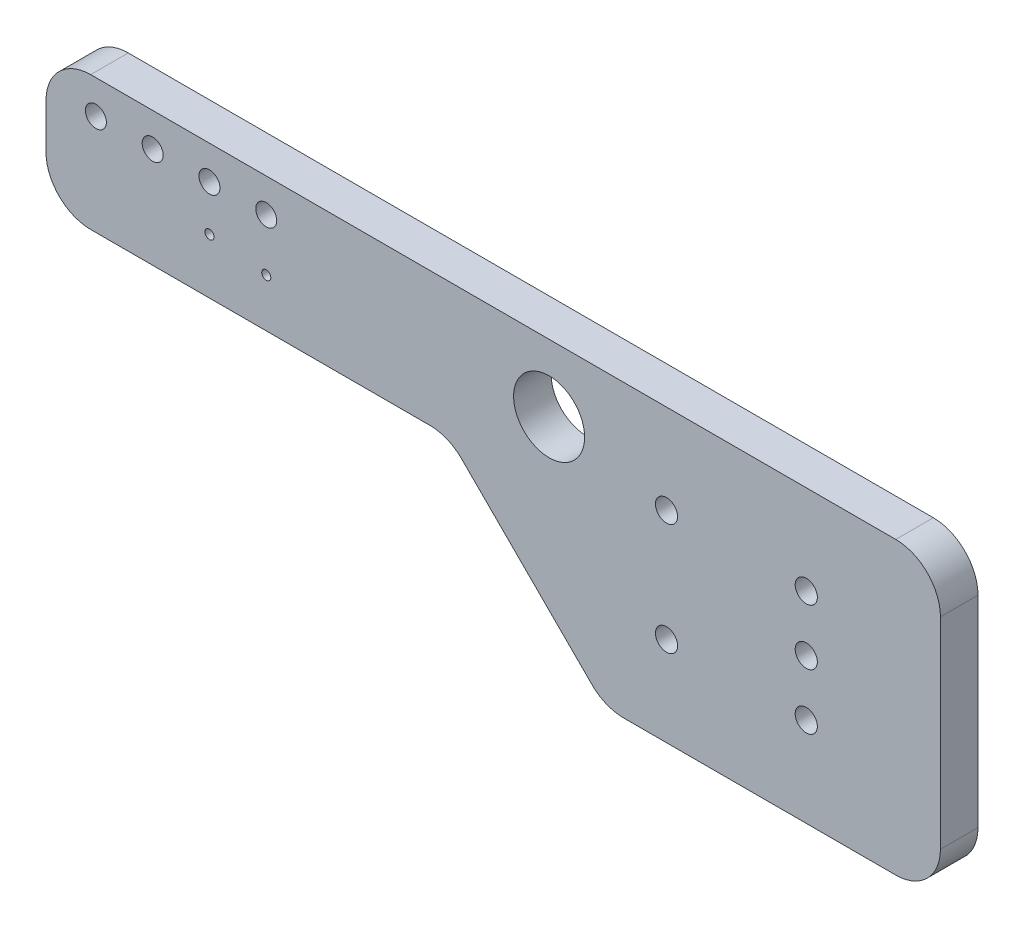
ISO-10303-21;
HEADER;
FILE_DESCRIPTION(('STEP AP214'),'2;1');
FILE_NAME('part.step','',(''),(''),'','','');
FILE_SCHEMA(('AUTOMOTIVE_DESIGN { 1 0 10303 214 1 1 1 1 }'));
ENDSEC;
DATA;
#1=APPLICATION_CONTEXT('core data for automotive mechanical design processes');
#2=APPLICATION_PROTOCOL_DEFINITION('international standard','automotive_design',2000,#1);
#3=PRODUCT_CONTEXT('',#1,'mechanical');
#4=PRODUCT('Part','Part','',(#3));
#5=PRODUCT_RELATED_PRODUCT_CATEGORY('part','',(#4));
#6=PRODUCT_DEFINITION_FORMATION('','',#4);
#7=PRODUCT_DEFINITION_CONTEXT('part definition',#1,'design');
#8=PRODUCT_DEFINITION('design','',#6,#7);
#9=PRODUCT_DEFINITION_SHAPE('','',#8);
#10=(LENGTH_UNIT() NAMED_UNIT(*) SI_UNIT(.MILLI.,.METRE.));
#11=(NAMED_UNIT(*) PLANE_ANGLE_UNIT() SI_UNIT($,.RADIAN.));
#12=(NAMED_UNIT(*) SI_UNIT($,.STERADIAN.) SOLID_ANGLE_UNIT());
#13=UNCERTAINTY_MEASURE_WITH_UNIT(LENGTH_MEASURE(1.E-05),#10,'distance_accuracy_value','');
#14=(GEOMETRIC_REPRESENTATION_CONTEXT(3) GLOBAL_UNCERTAINTY_ASSIGNED_CONTEXT((#13)) GLOBAL_UNIT_ASSIGNED_CONTEXT((#10,
#11,#12)) REPRESENTATION_CONTEXT('',''));
#15=CARTESIAN_POINT('',(0.,0.,0.));
#16=DIRECTION('',(0.,0.,1.));
#17=DIRECTION('',(1.,0.,0.));
#18=AXIS2_PLACEMENT_3D('',#15,#16,#17);
#19=CARTESIAN_POINT('',(61.9999999999996,62.9999999999982,1.68));
#20=DIRECTION('',(0.,0.,1.));
#21=DIRECTION('',(1.,0.,0.));
#22=AXIS2_PLACEMENT_3D('',#19,#20,#21);
#23=PLANE('',#22);
#24=CARTESIAN_POINT('',(94.0000000108,55.9999999886,1.68));
#25=DIRECTION('',(0.,0.,1.));
#26=DIRECTION('',(1.,0.,0.));
#27=AXIS2_PLACEMENT_3D('',#24,#25,#26);
#28=CIRCLE('',#27,0.495300000000004);
#29=CARTESIAN_POINT('',(94.4953000108,55.9999999886,1.68));
#30=VERTEX_POINT('',#29);
#31=EDGE_CURVE('E328',#30,#30,#28,.T.);
#32=ORIENTED_EDGE('',*,*,#31,.F.);
#33=EDGE_LOOP('',(#32));
#34=FACE_BOUND('',#33,.T.);
#35=CARTESIAN_POINT('',(87.7499999886,60.9999999962,1.68));
#36=DIRECTION('',(0.,0.,1.));
#37=DIRECTION('',(1.,0.,0.));
#38=AXIS2_PLACEMENT_3D('',#35,#36,#37);
#39=CIRCLE('',#38,0.495300000000004);
#40=CARTESIAN_POINT('',(88.2452999886,60.9999999962,1.68));
#41=VERTEX_POINT('',#40);
#42=EDGE_CURVE('E340',#41,#41,#39,.T.);
#43=ORIENTED_EDGE('',*,*,#42,.F.);
#44=EDGE_LOOP('',(#43));
#45=FACE_BOUND('',#44,.T.);
#46=CARTESIAN_POINT('',(82.4999999984,62.0000000028,1.68));
#47=DIRECTION('',(0.,0.,1.));
#48=DIRECTION('',(1.,0.,0.));
#49=AXIS2_PLACEMENT_3D('',#46,#47,#48);
#50=CIRCLE('',#49,1.58750000000001);
#51=CARTESIAN_POINT('',(84.0874999984,62.0000000028,1.68));
#52=VERTEX_POINT('',#51);
#53=EDGE_CURVE('E352',#52,#52,#50,.T.);
#54=ORIENTED_EDGE('',*,*,#53,.F.);
#55=EDGE_LOOP('',(#54));
#56=FACE_BOUND('',#55,.T.);
#57=CARTESIAN_POINT('',(69.85,61.1632,1.68));
#58=DIRECTION('',(0.,0.,1.));
#59=DIRECTION('',(1.,0.,0.));
#60=AXIS2_PLACEMENT_3D('',#57,#58,#59);
#61=CIRCLE('',#60,0.203200000000001);
#62=CARTESIAN_POINT('',(70.0532,61.1632,1.68));
#63=VERTEX_POINT('',#62);
#64=EDGE_CURVE('E364',#63,#63,#61,.T.);
#65=ORIENTED_EDGE('',*,*,#64,.F.);
#66=EDGE_LOOP('',(#65));
#67=FACE_BOUND('',#66,.T.);
#68=CARTESIAN_POINT('',(64.77,63.5,1.68));
#69=DIRECTION('',(0.,0.,1.));
#70=DIRECTION('',(1.,0.,0.));
#71=AXIS2_PLACEMENT_3D('',#68,#69,#70);
#72=CIRCLE('',#71,0.469899999999995);
#73=CARTESIAN_POINT('',(65.2399,63.5,1.68));
#74=VERTEX_POINT('',#73);
#75=EDGE_CURVE('E376',#74,#74,#72,.T.);
#76=ORIENTED_EDGE('',*,*,#75,.F.);
#77=EDGE_LOOP('',(#76));
#78=FACE_BOUND('',#77,.T.);
#79=CARTESIAN_POINT('',(67.31,61.468,1.68));
#80=DIRECTION('',(0.,0.,1.));
#81=DIRECTION('',(1.,0.,0.));
#82=AXIS2_PLACEMENT_3D('',#79,#80,#81);
#83=CIRCLE('',#82,0.203200000000001);
#84=CARTESIAN_POINT('',(67.5132,61.468,1.68));
#85=VERTEX_POINT('',#84);
#86=EDGE_CURVE('E162',#85,#85,#83,.T.);
#87=ORIENTED_EDGE('',*,*,#86,.F.);
#88=EDGE_LOOP('',(#87));
#89=FACE_BOUND('',#88,.T.);
#90=CARTESIAN_POINT('',(61.9999999999996,62.9999999999982,1.68));
#91=DIRECTION('',(0.,0.,1.));
#92=DIRECTION('',(1.,0.,0.));
#93=AXIS2_PLACEMENT_3D('',#90,#91,#92);
#94=CIRCLE('',#93,2.00000000000089);
#95=CARTESIAN_POINT('',(62.0000000000009,64.9999999999991,1.68));
#96=VERTEX_POINT('',#95);
#97=CARTESIAN_POINT('',(59.9999999999988,62.9999999999995,1.68));
#98=VERTEX_POINT('',#97);
#99=EDGE_CURVE('E181',#96,#98,#94,.T.);
#100=ORIENTED_EDGE('',*,*,#99,.T.);
#101=DIRECTION('',(0.,-1.,0.));
#102=VECTOR('',#101,1.);
#103=CARTESIAN_POINT('',(59.9999999999988,62.9999999999995,1.68));
#104=LINE('',#103,#102);
#105=CARTESIAN_POINT('',(59.9999999999988,60.9999999999998,1.68));
#106=VERTEX_POINT('',#105);
#107=EDGE_CURVE('E109',#98,#106,#104,.T.);
#108=ORIENTED_EDGE('',*,*,#107,.T.);
#109=CARTESIAN_POINT('',(61.9999999999997,61.0000000000011,1.68));
#110=DIRECTION('',(0.,0.,1.));
#111=DIRECTION('',(1.,0.,0.));
#112=AXIS2_PLACEMENT_3D('',#109,#110,#111);
#113=CIRCLE('',#112,2.00000000000089);
#114=CARTESIAN_POINT('',(62.0000000000009,59.0000000000002,1.68));
#115=VERTEX_POINT('',#114);
#116=EDGE_CURVE('E208',#106,#115,#113,.T.);
#117=ORIENTED_EDGE('',*,*,#116,.T.);
#118=DIRECTION('',(1.,0.,0.));
#119=VECTOR('',#118,1.);
#120=CARTESIAN_POINT('',(62.0000000000009,59.0000000000002,1.68));
#121=LINE('',#120,#119);
#122=CARTESIAN_POINT('',(77.1715726666679,59.0000000000002,1.68));
#123=VERTEX_POINT('',#122);
#124=EDGE_CURVE('E227',#115,#123,#121,.T.);
#125=ORIENTED_EDGE('',*,*,#124,.T.);
#126=CARTESIAN_POINT('',(77.1715726090055,56.999999357219,1.68));
#127=DIRECTION('',(0.,0.,-1.));
#128=DIRECTION('',(-1.,0.,0.));
#129=AXIS2_PLACEMENT_3D('',#126,#127,#128);
#130=CIRCLE('',#129,2.00000064278126);
#131=CARTESIAN_POINT('',(78.585786666667,58.4142133333336,1.68));
#132=VERTEX_POINT('',#131);
#133=EDGE_CURVE('E224',#123,#132,#130,.T.);
#134=ORIENTED_EDGE('',*,*,#133,.T.);
#135=DIRECTION('',(0.707106781186548,-0.707106781186547,0.));
#136=VECTOR('',#135,1.);
#137=CARTESIAN_POINT('',(78.585786666667,58.4142133333336,1.68));
#138=LINE('',#137,#136);
#139=CARTESIAN_POINT('',(84.4142133333337,52.5857866666669,1.68));
#140=VERTEX_POINT('',#139);
#141=EDGE_CURVE('E226',#132,#140,#138,.T.);
#142=ORIENTED_EDGE('',*,*,#141,.T.);
#143=CARTESIAN_POINT('',(85.8284273909953,54.0000006427815,1.68));
#144=DIRECTION('',(0.,0.,1.));
#145=DIRECTION('',(1.,0.,0.));
#146=AXIS2_PLACEMENT_3D('',#143,#144,#145);
#147=CIRCLE('',#146,2.00000064278127);
#148=CARTESIAN_POINT('',(85.8284273333329,52.0000000000003,1.68));
#149=VERTEX_POINT('',#148);
#150=EDGE_CURVE('E229',#140,#149,#147,.T.);
#151=ORIENTED_EDGE('',*,*,#150,.T.);
#152=DIRECTION('',(1.,0.,0.));
#153=VECTOR('',#152,1.);
#154=CARTESIAN_POINT('',(85.8284273333329,52.0000000000003,1.68));
#155=LINE('',#154,#153);
#156=CARTESIAN_POINT('',(97.9999999999991,52.0000000000003,1.68));
#157=VERTEX_POINT('',#156);
#158=EDGE_CURVE('E235',#149,#157,#155,.T.);
#159=ORIENTED_EDGE('',*,*,#158,.T.);
#160=CARTESIAN_POINT('',(97.9999999999991,53.9999999999999,1.68));
#161=DIRECTION('',(0.,0.,1.));
#162=DIRECTION('',(1.,0.,0.));
#163=AXIS2_PLACEMENT_3D('',#160,#161,#162);
#164=CIRCLE('',#163,1.99999999999964);
#165=CARTESIAN_POINT('',(99.9999999999988,53.9999999999999,1.68));
#166=VERTEX_POINT('',#165);
#167=EDGE_CURVE('E140',#157,#166,#164,.T.);
#168=ORIENTED_EDGE('',*,*,#167,.T.);
#169=DIRECTION('',(0.,1.,0.));
#170=VECTOR('',#169,1.);
#171=CARTESIAN_POINT('',(99.9999999999988,53.9999999999999,1.68));
#172=LINE('',#171,#170);
#173=CARTESIAN_POINT('',(99.9999999999988,62.9999999999995,1.68));
#174=VERTEX_POINT('',#173);
#175=EDGE_CURVE('E134',#166,#174,#172,.T.);
#176=ORIENTED_EDGE('',*,*,#175,.T.);
#177=CARTESIAN_POINT('',(97.9999999999992,62.9999999999994,1.68));
#178=DIRECTION('',(0.,0.,1.));
#179=DIRECTION('',(1.,0.,0.));
#180=AXIS2_PLACEMENT_3D('',#177,#178,#179);
#181=CIRCLE('',#180,1.99999999999963);
#182=CARTESIAN_POINT('',(97.9999999999991,64.9999999999991,1.68));
#183=VERTEX_POINT('',#182);
#184=EDGE_CURVE('E138',#174,#183,#181,.T.);
#185=ORIENTED_EDGE('',*,*,#184,.T.);
#186=DIRECTION('',(-1.,0.,0.));
#187=VECTOR('',#186,1.);
#188=CARTESIAN_POINT('',(97.9999999999991,64.9999999999991,1.68));
#189=LINE('',#188,#187);
#190=EDGE_CURVE('E54',#183,#96,#189,.T.);
#191=ORIENTED_EDGE('',*,*,#190,.T.);
#192=EDGE_LOOP('',(#100,#108,#117,#125,#134,#142,#151,#159,#168,#176,#185,#191));
#193=FACE_BOUND('',#192,.T.);
#194=CARTESIAN_POINT('',(62.23,63.5,1.68));
#195=DIRECTION('',(0.,0.,1.));
#196=DIRECTION('',(1.,0.,0.));
#197=AXIS2_PLACEMENT_3D('',#194,#195,#196);
#198=CIRCLE('',#197,0.469899999999995);
#199=CARTESIAN_POINT('',(62.6999,63.5,1.68));
#200=VERTEX_POINT('',#199);
#201=EDGE_CURVE('E382',#200,#200,#198,.T.);
#202=ORIENTED_EDGE('',*,*,#201,.F.);
#203=EDGE_LOOP('',(#202));
#204=FACE_BOUND('',#203,.T.);
#205=CARTESIAN_POINT('',(67.31,63.5,1.68));
#206=DIRECTION('',(0.,0.,1.));
#207=DIRECTION('',(1.,0.,0.));
#208=AXIS2_PLACEMENT_3D('',#205,#206,#207);
#209=CIRCLE('',#208,0.469899999999995);
#210=CARTESIAN_POINT('',(67.7799,63.5,1.68));
#211=VERTEX_POINT('',#210);
#212=EDGE_CURVE('E370',#211,#211,#209,.T.);
#213=ORIENTED_EDGE('',*,*,#212,.F.);
#214=EDGE_LOOP('',(#213));
#215=FACE_BOUND('',#214,.T.);
#216=CARTESIAN_POINT('',(69.85,63.5,1.68));
#217=DIRECTION('',(0.,0.,1.));
#218=DIRECTION('',(1.,0.,0.));
#219=AXIS2_PLACEMENT_3D('',#216,#217,#218);
#220=CIRCLE('',#219,0.469899999999995);
#221=CARTESIAN_POINT('',(70.3199,63.5,1.68));
#222=VERTEX_POINT('',#221);
#223=EDGE_CURVE('E358',#222,#222,#220,.T.);
#224=ORIENTED_EDGE('',*,*,#223,.F.);
#225=EDGE_LOOP('',(#224));
#226=FACE_BOUND('',#225,.T.);
#227=CARTESIAN_POINT('',(87.7499999886,55.9999999886,1.68));
#228=DIRECTION('',(0.,0.,1.));
#229=DIRECTION('',(1.,0.,0.));
#230=AXIS2_PLACEMENT_3D('',#227,#228,#229);
#231=CIRCLE('',#230,0.495300000000004);
#232=CARTESIAN_POINT('',(88.2452999886,55.9999999886,1.68));
#233=VERTEX_POINT('',#232);
#234=EDGE_CURVE('E346',#233,#233,#231,.T.);
#235=ORIENTED_EDGE('',*,*,#234,.F.);
#236=EDGE_LOOP('',(#235));
#237=FACE_BOUND('',#236,.T.);
#238=CARTESIAN_POINT('',(94.0000000108,58.4999999924,1.68));
#239=DIRECTION('',(0.,0.,1.));
#240=DIRECTION('',(1.,0.,0.));
#241=AXIS2_PLACEMENT_3D('',#238,#239,#240);
#242=CIRCLE('',#241,0.495300000000004);
#243=CARTESIAN_POINT('',(94.4953000108,58.4999999924,1.68));
#244=VERTEX_POINT('',#243);
#245=EDGE_CURVE('E334',#244,#244,#242,.T.);
#246=ORIENTED_EDGE('',*,*,#245,.F.);
#247=EDGE_LOOP('',(#246));
#248=FACE_BOUND('',#247,.T.);
#249=CARTESIAN_POINT('',(94.0000000108,60.9999999962,1.68));
#250=DIRECTION('',(0.,0.,1.));
#251=DIRECTION('',(1.,0.,0.));
#252=AXIS2_PLACEMENT_3D('',#249,#250,#251);
#253=CIRCLE('',#252,0.495300000000004);
#254=CARTESIAN_POINT('',(94.4953000108,60.9999999962,1.68));
#255=VERTEX_POINT('',#254);
#256=EDGE_CURVE('E319',#255,#255,#253,.T.);
#257=ORIENTED_EDGE('',*,*,#256,.F.);
#258=EDGE_LOOP('',(#257));
#259=FACE_BOUND('',#258,.T.);
#260=ADVANCED_FACE('F37',(#34,#45,#56,#67,#78,#89,#193,#204,#215,#226,#237,#248,#259),#23,.T.);
#261=CARTESIAN_POINT('',(61.9999999999996,62.9999999999982,0.));
#262=DIRECTION('',(0.,0.,1.));
#263=DIRECTION('',(1.,0.,0.));
#264=AXIS2_PLACEMENT_3D('',#261,#262,#263);
#265=PLANE('',#264);
#266=CARTESIAN_POINT('',(94.0000000108,55.9999999886,0.));
#267=DIRECTION('',(0.,0.,1.));
#268=DIRECTION('',(1.,0.,0.));
#269=AXIS2_PLACEMENT_3D('',#266,#267,#268);
#270=CIRCLE('',#269,0.495300000000004);
#271=CARTESIAN_POINT('',(94.4953000108,55.9999999886,0.));
#272=VERTEX_POINT('',#271);
#273=EDGE_CURVE('E325',#272,#272,#270,.T.);
#274=ORIENTED_EDGE('',*,*,#273,.T.);
#275=EDGE_LOOP('',(#274));
#276=FACE_BOUND('',#275,.T.);
#277=CARTESIAN_POINT('',(87.7499999886,60.9999999962,0.));
#278=DIRECTION('',(0.,0.,1.));
#279=DIRECTION('',(1.,0.,0.));
#280=AXIS2_PLACEMENT_3D('',#277,#278,#279);
#281=CIRCLE('',#280,0.495300000000004);
#282=CARTESIAN_POINT('',(88.2452999886,60.9999999962,0.));
#283=VERTEX_POINT('',#282);
#284=EDGE_CURVE('E337',#283,#283,#281,.T.);
#285=ORIENTED_EDGE('',*,*,#284,.T.);
#286=EDGE_LOOP('',(#285));
#287=FACE_BOUND('',#286,.T.);
#288=CARTESIAN_POINT('',(82.4999999984,62.0000000028,0.));
#289=DIRECTION('',(0.,0.,1.));
#290=DIRECTION('',(1.,0.,0.));
#291=AXIS2_PLACEMENT_3D('',#288,#289,#290);
#292=CIRCLE('',#291,1.58750000000001);
#293=CARTESIAN_POINT('',(84.0874999984,62.0000000028,0.));
#294=VERTEX_POINT('',#293);
#295=EDGE_CURVE('E349',#294,#294,#292,.T.);
#296=ORIENTED_EDGE('',*,*,#295,.T.);
#297=EDGE_LOOP('',(#296));
#298=FACE_BOUND('',#297,.T.);
#299=CARTESIAN_POINT('',(69.85,61.1632,0.));
#300=DIRECTION('',(0.,0.,1.));
#301=DIRECTION('',(1.,0.,0.));
#302=AXIS2_PLACEMENT_3D('',#299,#300,#301);
#303=CIRCLE('',#302,0.203200000000001);
#304=CARTESIAN_POINT('',(70.0532,61.1632,0.));
#305=VERTEX_POINT('',#304);
#306=EDGE_CURVE('E361',#305,#305,#303,.T.);
#307=ORIENTED_EDGE('',*,*,#306,.T.);
#308=EDGE_LOOP('',(#307));
#309=FACE_BOUND('',#308,.T.);
#310=CARTESIAN_POINT('',(64.77,63.5,0.));
#311=DIRECTION('',(0.,0.,1.));
#312=DIRECTION('',(1.,0.,0.));
#313=AXIS2_PLACEMENT_3D('',#310,#311,#312);
#314=CIRCLE('',#313,0.469899999999995);
#315=CARTESIAN_POINT('',(65.2399,63.5,0.));
#316=VERTEX_POINT('',#315);
#317=EDGE_CURVE('E373',#316,#316,#314,.T.);
#318=ORIENTED_EDGE('',*,*,#317,.T.);
#319=EDGE_LOOP('',(#318));
#320=FACE_BOUND('',#319,.T.);
#321=CARTESIAN_POINT('',(67.31,61.468,0.));
#322=DIRECTION('',(0.,0.,1.));
#323=DIRECTION('',(1.,0.,0.));
#324=AXIS2_PLACEMENT_3D('',#321,#322,#323);
#325=CIRCLE('',#324,0.203200000000001);
#326=CARTESIAN_POINT('',(67.5132,61.468,0.));
#327=VERTEX_POINT('',#326);
#328=EDGE_CURVE('E385',#327,#327,#325,.T.);
#329=ORIENTED_EDGE('',*,*,#328,.T.);
#330=EDGE_LOOP('',(#329));
#331=FACE_BOUND('',#330,.T.);
#332=CARTESIAN_POINT('',(61.9999999999996,62.9999999999982,0.));
#333=DIRECTION('',(0.,0.,1.));
#334=DIRECTION('',(1.,0.,0.));
#335=AXIS2_PLACEMENT_3D('',#332,#333,#334);
#336=CIRCLE('',#335,2.00000000000089);
#337=CARTESIAN_POINT('',(62.0000000000009,64.9999999999991,0.));
#338=VERTEX_POINT('',#337);
#339=CARTESIAN_POINT('',(59.9999999999988,62.9999999999995,0.));
#340=VERTEX_POINT('',#339);
#341=EDGE_CURVE('E158',#338,#340,#336,.T.);
#342=ORIENTED_EDGE('',*,*,#341,.F.);
#343=DIRECTION('',(-1.,0.,0.));
#344=VECTOR('',#343,1.);
#345=CARTESIAN_POINT('',(97.9999999999991,64.9999999999991,0.));
#346=LINE('',#345,#344);
#347=CARTESIAN_POINT('',(97.9999999999991,64.9999999999991,0.));
#348=VERTEX_POINT('',#347);
#349=EDGE_CURVE('E101',#348,#338,#346,.T.);
#350=ORIENTED_EDGE('',*,*,#349,.F.);
#351=CARTESIAN_POINT('',(97.9999999999992,62.9999999999994,0.));
#352=DIRECTION('',(0.,0.,1.));
#353=DIRECTION('',(1.,0.,0.));
#354=AXIS2_PLACEMENT_3D('',#351,#352,#353);
#355=CIRCLE('',#354,1.99999999999963);
#356=CARTESIAN_POINT('',(99.9999999999988,62.9999999999995,0.));
#357=VERTEX_POINT('',#356);
#358=EDGE_CURVE('E95',#357,#348,#355,.T.);
#359=ORIENTED_EDGE('',*,*,#358,.F.);
#360=DIRECTION('',(0.,1.,0.));
#361=VECTOR('',#360,1.);
#362=CARTESIAN_POINT('',(99.9999999999988,53.9999999999999,0.));
#363=LINE('',#362,#361);
#364=CARTESIAN_POINT('',(99.9999999999988,53.9999999999999,0.));
#365=VERTEX_POINT('',#364);
#366=EDGE_CURVE('E148',#365,#357,#363,.T.);
#367=ORIENTED_EDGE('',*,*,#366,.F.);
#368=CARTESIAN_POINT('',(97.9999999999991,53.9999999999999,0.));
#369=DIRECTION('',(0.,0.,1.));
#370=DIRECTION('',(1.,0.,0.));
#371=AXIS2_PLACEMENT_3D('',#368,#369,#370);
#372=CIRCLE('',#371,1.99999999999964);
#373=CARTESIAN_POINT('',(97.9999999999991,52.0000000000003,0.));
#374=VERTEX_POINT('',#373);
#375=EDGE_CURVE('E176',#374,#365,#372,.T.);
#376=ORIENTED_EDGE('',*,*,#375,.F.);
#377=DIRECTION('',(1.,0.,0.));
#378=VECTOR('',#377,1.);
#379=CARTESIAN_POINT('',(85.8284273333329,52.0000000000003,0.));
#380=LINE('',#379,#378);
#381=CARTESIAN_POINT('',(85.8284273333329,52.0000000000003,0.));
#382=VERTEX_POINT('',#381);
#383=EDGE_CURVE('E174',#382,#374,#380,.T.);
#384=ORIENTED_EDGE('',*,*,#383,.F.);
#385=CARTESIAN_POINT('',(85.8284273909953,54.0000006427815,0.));
#386=DIRECTION('',(0.,0.,1.));
#387=DIRECTION('',(1.,0.,0.));
#388=AXIS2_PLACEMENT_3D('',#385,#386,#387);
#389=CIRCLE('',#388,2.00000064278127);
#390=CARTESIAN_POINT('',(84.4142133333337,52.5857866666669,0.));
#391=VERTEX_POINT('',#390);
#392=EDGE_CURVE('E172',#391,#382,#389,.T.);
#393=ORIENTED_EDGE('',*,*,#392,.F.);
#394=DIRECTION('',(0.707106781186548,-0.707106781186547,0.));
#395=VECTOR('',#394,1.);
#396=CARTESIAN_POINT('',(78.585786666667,58.4142133333336,0.));
#397=LINE('',#396,#395);
#398=CARTESIAN_POINT('',(78.585786666667,58.4142133333336,0.));
#399=VERTEX_POINT('',#398);
#400=EDGE_CURVE('E170',#399,#391,#397,.T.);
#401=ORIENTED_EDGE('',*,*,#400,.F.);
#402=CARTESIAN_POINT('',(77.1715726090055,56.999999357219,0.));
#403=DIRECTION('',(0.,0.,-1.));
#404=DIRECTION('',(-1.,0.,0.));
#405=AXIS2_PLACEMENT_3D('',#402,#403,#404);
#406=CIRCLE('',#405,2.00000064278126);
#407=CARTESIAN_POINT('',(77.1715726666679,59.0000000000002,0.));
#408=VERTEX_POINT('',#407);
#409=EDGE_CURVE('E168',#408,#399,#406,.T.);
#410=ORIENTED_EDGE('',*,*,#409,.F.);
#411=DIRECTION('',(1.,0.,0.));
#412=VECTOR('',#411,1.);
#413=CARTESIAN_POINT('',(62.0000000000009,59.0000000000002,0.));
#414=LINE('',#413,#412);
#415=CARTESIAN_POINT('',(62.0000000000009,59.0000000000002,0.));
#416=VERTEX_POINT('',#415);
#417=EDGE_CURVE('E166',#416,#408,#414,.T.);
#418=ORIENTED_EDGE('',*,*,#417,.F.);
#419=CARTESIAN_POINT('',(61.9999999999997,61.0000000000011,0.));
#420=DIRECTION('',(0.,0.,1.));
#421=DIRECTION('',(1.,0.,0.));
#422=AXIS2_PLACEMENT_3D('',#419,#420,#421);
#423=CIRCLE('',#422,2.00000000000089);
#424=CARTESIAN_POINT('',(59.9999999999988,60.9999999999998,0.));
#425=VERTEX_POINT('',#424);
#426=EDGE_CURVE('E164',#425,#416,#423,.T.);
#427=ORIENTED_EDGE('',*,*,#426,.F.);
#428=DIRECTION('',(0.,-1.,0.));
#429=VECTOR('',#428,1.);
#430=CARTESIAN_POINT('',(59.9999999999988,62.9999999999995,0.));
#431=LINE('',#430,#429);
#432=EDGE_CURVE('E161',#340,#425,#431,.T.);
#433=ORIENTED_EDGE('',*,*,#432,.F.);
#434=EDGE_LOOP('',(#342,#350,#359,#367,#376,#384,#393,#401,#410,#418,#427,#433));
#435=FACE_BOUND('',#434,.T.);
#436=CARTESIAN_POINT('',(62.23,63.5,0.));
#437=DIRECTION('',(0.,0.,1.));
#438=DIRECTION('',(1.,0.,0.));
#439=AXIS2_PLACEMENT_3D('',#436,#437,#438);
#440=CIRCLE('',#439,0.469899999999995);
#441=CARTESIAN_POINT('',(62.6999,63.5,0.));
#442=VERTEX_POINT('',#441);
#443=EDGE_CURVE('E379',#442,#442,#440,.T.);
#444=ORIENTED_EDGE('',*,*,#443,.T.);
#445=EDGE_LOOP('',(#444));
#446=FACE_BOUND('',#445,.T.);
#447=CARTESIAN_POINT('',(67.31,63.5,0.));
#448=DIRECTION('',(0.,0.,1.));
#449=DIRECTION('',(1.,0.,0.));
#450=AXIS2_PLACEMENT_3D('',#447,#448,#449);
#451=CIRCLE('',#450,0.469899999999995);
#452=CARTESIAN_POINT('',(67.7799,63.5,0.));
#453=VERTEX_POINT('',#452);
#454=EDGE_CURVE('E367',#453,#453,#451,.T.);
#455=ORIENTED_EDGE('',*,*,#454,.T.);
#456=EDGE_LOOP('',(#455));
#457=FACE_BOUND('',#456,.T.);
#458=CARTESIAN_POINT('',(69.85,63.5,0.));
#459=DIRECTION('',(0.,0.,1.));
#460=DIRECTION('',(1.,0.,0.));
#461=AXIS2_PLACEMENT_3D('',#458,#459,#460);
#462=CIRCLE('',#461,0.469899999999995);
#463=CARTESIAN_POINT('',(70.3199,63.5,0.));
#464=VERTEX_POINT('',#463);
#465=EDGE_CURVE('E355',#464,#464,#462,.T.);
#466=ORIENTED_EDGE('',*,*,#465,.T.);
#467=EDGE_LOOP('',(#466));
#468=FACE_BOUND('',#467,.T.);
#469=CARTESIAN_POINT('',(87.7499999886,55.9999999886,0.));
#470=DIRECTION('',(0.,0.,1.));
#471=DIRECTION('',(1.,0.,0.));
#472=AXIS2_PLACEMENT_3D('',#469,#470,#471);
#473=CIRCLE('',#472,0.495300000000004);
#474=CARTESIAN_POINT('',(88.2452999886,55.9999999886,0.));
#475=VERTEX_POINT('',#474);
#476=EDGE_CURVE('E343',#475,#475,#473,.T.);
#477=ORIENTED_EDGE('',*,*,#476,.T.);
#478=EDGE_LOOP('',(#477));
#479=FACE_BOUND('',#478,.T.);
#480=CARTESIAN_POINT('',(94.0000000108,58.4999999924,0.));
#481=DIRECTION('',(0.,0.,1.));
#482=DIRECTION('',(1.,0.,0.));
#483=AXIS2_PLACEMENT_3D('',#480,#481,#482);
#484=CIRCLE('',#483,0.495300000000004);
#485=CARTESIAN_POINT('',(94.4953000108,58.4999999924,0.));
#486=VERTEX_POINT('',#485);
#487=EDGE_CURVE('E331',#486,#486,#484,.T.);
#488=ORIENTED_EDGE('',*,*,#487,.T.);
#489=EDGE_LOOP('',(#488));
#490=FACE_BOUND('',#489,.T.);
#491=CARTESIAN_POINT('',(94.0000000108,60.9999999962,0.));
#492=DIRECTION('',(0.,0.,1.));
#493=DIRECTION('',(1.,0.,0.));
#494=AXIS2_PLACEMENT_3D('',#491,#492,#493);
#495=CIRCLE('',#494,0.495300000000004);
#496=CARTESIAN_POINT('',(94.4953000108,60.9999999962,0.));
#497=VERTEX_POINT('',#496);
#498=EDGE_CURVE('E322',#497,#497,#495,.T.);
#499=ORIENTED_EDGE('',*,*,#498,.T.);
#500=EDGE_LOOP('',(#499));
#501=FACE_BOUND('',#500,.T.);
#502=ADVANCED_FACE('F212',(#276,#287,#298,#309,#320,#331,#435,#446,#457,#468,#479,#490,#501),
#265,.F.);
#503=CARTESIAN_POINT('',(61.9999999999996,62.9999999999982,1.68));
#504=DIRECTION('',(0.,0.,-1.));
#505=DIRECTION('',(-1.,0.,0.));
#506=AXIS2_PLACEMENT_3D('',#503,#504,#505);
#507=CYLINDRICAL_SURFACE('',#506,2.00000000000089);
#508=ORIENTED_EDGE('',*,*,#341,.T.);
#509=DIRECTION('',(0.,0.,-1.));
#510=VECTOR('',#509,1.);
#511=CARTESIAN_POINT('',(59.9999999999988,62.9999999999995,1.68));
#512=LINE('',#511,#510);
#513=EDGE_CURVE('E11',#98,#340,#512,.T.);
#514=ORIENTED_EDGE('',*,*,#513,.F.);
#515=ORIENTED_EDGE('',*,*,#99,.F.);
#516=DIRECTION('',(0.,0.,-1.));
#517=VECTOR('',#516,1.);
#518=CARTESIAN_POINT('',(62.0000000000009,64.9999999999991,1.68));
#519=LINE('',#518,#517);
#520=EDGE_CURVE('E154',#96,#338,#519,.T.);
#521=ORIENTED_EDGE('',*,*,#520,.T.);
#522=EDGE_LOOP('',(#508,#514,#515,#521));
#523=FACE_BOUND('',#522,.T.);
#524=ADVANCED_FACE('F39',(#523),#507,.T.);
#525=CARTESIAN_POINT('',(59.9999999999988,62.9999999999995,1.68));
#526=DIRECTION('',(1.,0.,0.));
#527=DIRECTION('',(0.,0.,-1.));
#528=AXIS2_PLACEMENT_3D('',#525,#526,#527);
#529=PLANE('',#528);
#530=ORIENTED_EDGE('',*,*,#432,.T.);
#531=DIRECTION('',(0.,0.,-1.));
#532=VECTOR('',#531,1.);
#533=CARTESIAN_POINT('',(59.9999999999988,60.9999999999998,1.68));
#534=LINE('',#533,#532);
#535=EDGE_CURVE('E46',#106,#425,#534,.T.);
#536=ORIENTED_EDGE('',*,*,#535,.F.);
#537=ORIENTED_EDGE('',*,*,#107,.F.);
#538=ORIENTED_EDGE('',*,*,#513,.T.);
#539=EDGE_LOOP('',(#530,#536,#537,#538));
#540=FACE_BOUND('',#539,.T.);
#541=ADVANCED_FACE('F577',(#540),#529,.F.);
#542=CARTESIAN_POINT('',(61.9999999999997,61.0000000000011,1.68));
#543=DIRECTION('',(0.,0.,-1.));
#544=DIRECTION('',(-1.,0.,0.));
#545=AXIS2_PLACEMENT_3D('',#542,#543,#544);
#546=CYLINDRICAL_SURFACE('',#545,2.00000000000089);
#547=ORIENTED_EDGE('',*,*,#426,.T.);
#548=DIRECTION('',(0.,0.,-1.));
#549=VECTOR('',#548,1.);
#550=CARTESIAN_POINT('',(62.0000000000009,59.0000000000002,1.68));
#551=LINE('',#550,#549);
#552=EDGE_CURVE('E200',#115,#416,#551,.T.);
#553=ORIENTED_EDGE('',*,*,#552,.F.);
#554=ORIENTED_EDGE('',*,*,#116,.F.);
#555=ORIENTED_EDGE('',*,*,#535,.T.);
#556=EDGE_LOOP('',(#547,#553,#554,#555));
#557=FACE_BOUND('',#556,.T.);
#558=ADVANCED_FACE('F206',(#557),#546,.T.);
#559=CARTESIAN_POINT('',(62.0000000000009,59.0000000000002,1.68));
#560=DIRECTION('',(0.,1.,0.));
#561=DIRECTION('',(0.,0.,1.));
#562=AXIS2_PLACEMENT_3D('',#559,#560,#561);
#563=PLANE('',#562);
#564=ORIENTED_EDGE('',*,*,#417,.T.);
#565=DIRECTION('',(0.,0.,-1.));
#566=VECTOR('',#565,1.);
#567=CARTESIAN_POINT('',(77.1715726666679,59.0000000000002,1.68));
#568=LINE('',#567,#566);
#569=EDGE_CURVE('E197',#123,#408,#568,.T.);
#570=ORIENTED_EDGE('',*,*,#569,.F.);
#571=ORIENTED_EDGE('',*,*,#124,.F.);
#572=ORIENTED_EDGE('',*,*,#552,.T.);
#573=EDGE_LOOP('',(#564,#570,#571,#572));
#574=FACE_BOUND('',#573,.T.);
#575=ADVANCED_FACE('F218',(#574),#563,.F.);
#576=CARTESIAN_POINT('',(77.1715726090055,56.999999357219,1.68));
#577=DIRECTION('',(0.,0.,-1.));
#578=DIRECTION('',(-1.,0.,0.));
#579=AXIS2_PLACEMENT_3D('',#576,#577,#578);
#580=CYLINDRICAL_SURFACE('',#579,2.00000064278126);
#581=ORIENTED_EDGE('',*,*,#409,.T.);
#582=DIRECTION('',(0.,0.,-1.));
#583=VECTOR('',#582,1.);
#584=CARTESIAN_POINT('',(78.585786666667,58.4142133333336,1.68));
#585=LINE('',#584,#583);
#586=EDGE_CURVE('E194',#132,#399,#585,.T.);
#587=ORIENTED_EDGE('',*,*,#586,.F.);
#588=ORIENTED_EDGE('',*,*,#133,.F.);
#589=ORIENTED_EDGE('',*,*,#569,.T.);
#590=EDGE_LOOP('',(#581,#587,#588,#589));
#591=FACE_BOUND('',#590,.T.);
#592=ADVANCED_FACE('F222',(#591),#580,.F.);
#593=CARTESIAN_POINT('',(78.585786666667,58.4142133333336,1.68));
#594=DIRECTION('',(0.707106781186547,0.707106781186548,0.));
#595=DIRECTION('',(-0.707106781186548,0.707106781186547,0.));
#596=AXIS2_PLACEMENT_3D('',#593,#594,#595);
#597=PLANE('',#596);
#598=ORIENTED_EDGE('',*,*,#400,.T.);
#599=DIRECTION('',(0.,0.,-1.));
#600=VECTOR('',#599,1.);
#601=CARTESIAN_POINT('',(84.4142133333337,52.5857866666669,1.68));
#602=LINE('',#601,#600);
#603=EDGE_CURVE('E191',#140,#391,#602,.T.);
#604=ORIENTED_EDGE('',*,*,#603,.F.);
#605=ORIENTED_EDGE('',*,*,#141,.F.);
#606=ORIENTED_EDGE('',*,*,#586,.T.);
#607=EDGE_LOOP('',(#598,#604,#605,#606));
#608=FACE_BOUND('',#607,.T.);
#609=ADVANCED_FACE('F542',(#608),#597,.F.);
#610=CARTESIAN_POINT('',(85.8284273909953,54.0000006427815,1.68));
#611=DIRECTION('',(0.,0.,-1.));
#612=DIRECTION('',(-1.,0.,0.));
#613=AXIS2_PLACEMENT_3D('',#610,#611,#612);
#614=CYLINDRICAL_SURFACE('',#613,2.00000064278127);
#615=ORIENTED_EDGE('',*,*,#392,.T.);
#616=DIRECTION('',(0.,0.,-1.));
#617=VECTOR('',#616,1.);
#618=CARTESIAN_POINT('',(85.8284273333329,52.0000000000003,1.68));
#619=LINE('',#618,#617);
#620=EDGE_CURVE('E188',#149,#382,#619,.T.);
#621=ORIENTED_EDGE('',*,*,#620,.F.);
#622=ORIENTED_EDGE('',*,*,#150,.F.);
#623=ORIENTED_EDGE('',*,*,#603,.T.);
#624=EDGE_LOOP('',(#615,#621,#622,#623));
#625=FACE_BOUND('',#624,.T.);
#626=ADVANCED_FACE('F533',(#625),#614,.T.);
#627=CARTESIAN_POINT('',(85.8284273333329,52.0000000000003,1.68));
#628=DIRECTION('',(0.,1.,0.));
#629=DIRECTION('',(0.,0.,1.));
#630=AXIS2_PLACEMENT_3D('',#627,#628,#629);
#631=PLANE('',#630);
#632=ORIENTED_EDGE('',*,*,#383,.T.);
#633=DIRECTION('',(0.,0.,-1.));
#634=VECTOR('',#633,1.);
#635=CARTESIAN_POINT('',(97.9999999999991,52.0000000000003,1.68));
#636=LINE('',#635,#634);
#637=EDGE_CURVE('E185',#157,#374,#636,.T.);
#638=ORIENTED_EDGE('',*,*,#637,.F.);
#639=ORIENTED_EDGE('',*,*,#158,.F.);
#640=ORIENTED_EDGE('',*,*,#620,.T.);
#641=EDGE_LOOP('',(#632,#638,#639,#640));
#642=FACE_BOUND('',#641,.T.);
#643=ADVANCED_FACE('F241',(#642),#631,.F.);
#644=CARTESIAN_POINT('',(97.9999999999991,53.9999999999999,1.68));
#645=DIRECTION('',(0.,0.,-1.));
#646=DIRECTION('',(-1.,0.,0.));
#647=AXIS2_PLACEMENT_3D('',#644,#645,#646);
#648=CYLINDRICAL_SURFACE('',#647,1.99999999999964);
#649=ORIENTED_EDGE('',*,*,#375,.T.);
#650=DIRECTION('',(0.,0.,-1.));
#651=VECTOR('',#650,1.);
#652=CARTESIAN_POINT('',(99.9999999999988,53.9999999999999,1.68));
#653=LINE('',#652,#651);
#654=EDGE_CURVE('E149',#166,#365,#653,.T.);
#655=ORIENTED_EDGE('',*,*,#654,.F.);
#656=ORIENTED_EDGE('',*,*,#167,.F.);
#657=ORIENTED_EDGE('',*,*,#637,.T.);
#658=EDGE_LOOP('',(#649,#655,#656,#657));
#659=FACE_BOUND('',#658,.T.);
#660=ADVANCED_FACE('F245',(#659),#648,.T.);
#661=CARTESIAN_POINT('',(99.9999999999988,53.9999999999999,1.68));
#662=DIRECTION('',(-1.,0.,0.));
#663=DIRECTION('',(0.,0.,1.));
#664=AXIS2_PLACEMENT_3D('',#661,#662,#663);
#665=PLANE('',#664);
#666=ORIENTED_EDGE('',*,*,#366,.T.);
#667=DIRECTION('',(0.,0.,-1.));
#668=VECTOR('',#667,1.);
#669=CARTESIAN_POINT('',(99.9999999999988,62.9999999999995,1.68));
#670=LINE('',#669,#668);
#671=EDGE_CURVE('E145',#174,#357,#670,.T.);
#672=ORIENTED_EDGE('',*,*,#671,.F.);
#673=ORIENTED_EDGE('',*,*,#175,.F.);
#674=ORIENTED_EDGE('',*,*,#654,.T.);
#675=EDGE_LOOP('',(#666,#672,#673,#674));
#676=FACE_BOUND('',#675,.T.);
#677=ADVANCED_FACE('F146',(#676),#665,.F.);
#678=CARTESIAN_POINT('',(97.9999999999992,62.9999999999994,1.68));
#679=DIRECTION('',(0.,0.,-1.));
#680=DIRECTION('',(-1.,0.,0.));
#681=AXIS2_PLACEMENT_3D('',#678,#679,#680);
#682=CYLINDRICAL_SURFACE('',#681,1.99999999999963);
#683=ORIENTED_EDGE('',*,*,#358,.T.);
#684=DIRECTION('',(0.,0.,-1.));
#685=VECTOR('',#684,1.);
#686=CARTESIAN_POINT('',(97.9999999999991,64.9999999999991,1.68));
#687=LINE('',#686,#685);
#688=EDGE_CURVE('E150',#183,#348,#687,.T.);
#689=ORIENTED_EDGE('',*,*,#688,.F.);
#690=ORIENTED_EDGE('',*,*,#184,.F.);
#691=ORIENTED_EDGE('',*,*,#671,.T.);
#692=EDGE_LOOP('',(#683,#689,#690,#691));
#693=FACE_BOUND('',#692,.T.);
#694=ADVANCED_FACE('F152',(#693),#682,.T.);
#695=CARTESIAN_POINT('',(97.9999999999991,64.9999999999991,1.68));
#696=DIRECTION('',(0.,-1.,0.));
#697=DIRECTION('',(0.,0.,-1.));
#698=AXIS2_PLACEMENT_3D('',#695,#696,#697);
#699=PLANE('',#698);
#700=ORIENTED_EDGE('',*,*,#349,.T.);
#701=ORIENTED_EDGE('',*,*,#520,.F.);
#702=ORIENTED_EDGE('',*,*,#190,.F.);
#703=ORIENTED_EDGE('',*,*,#688,.T.);
#704=EDGE_LOOP('',(#700,#701,#702,#703));
#705=FACE_BOUND('',#704,.T.);
#706=ADVANCED_FACE('F249',(#705),#699,.F.);
#707=CARTESIAN_POINT('',(67.31,61.468,1.68));
#708=DIRECTION('',(0.,0.,-1.));
#709=DIRECTION('',(-1.,0.,0.));
#710=AXIS2_PLACEMENT_3D('',#707,#708,#709);
#711=CYLINDRICAL_SURFACE('',#710,0.203200000000001);
#712=ORIENTED_EDGE('',*,*,#86,.T.);
#713=EDGE_LOOP('',(#712));
#714=FACE_BOUND('',#713,.T.);
#715=ORIENTED_EDGE('',*,*,#328,.F.);
#716=EDGE_LOOP('',(#715));
#717=FACE_BOUND('',#716,.T.);
#718=ADVANCED_FACE('F251',(#714,#717),#711,.F.);
#719=CARTESIAN_POINT('',(62.23,63.5,1.68));
#720=DIRECTION('',(0.,0.,-1.));
#721=DIRECTION('',(-1.,0.,0.));
#722=AXIS2_PLACEMENT_3D('',#719,#720,#721);
#723=CYLINDRICAL_SURFACE('',#722,0.469899999999995);
#724=ORIENTED_EDGE('',*,*,#201,.T.);
#725=EDGE_LOOP('',(#724));
#726=FACE_BOUND('',#725,.T.);
#727=ORIENTED_EDGE('',*,*,#443,.F.);
#728=EDGE_LOOP('',(#727));
#729=FACE_BOUND('',#728,.T.);
#730=ADVANCED_FACE('F257',(#726,#729),#723,.F.);
#731=CARTESIAN_POINT('',(64.77,63.5,1.68));
#732=DIRECTION('',(0.,0.,-1.));
#733=DIRECTION('',(-1.,0.,0.));
#734=AXIS2_PLACEMENT_3D('',#731,#732,#733);
#735=CYLINDRICAL_SURFACE('',#734,0.469899999999995);
#736=ORIENTED_EDGE('',*,*,#75,.T.);
#737=EDGE_LOOP('',(#736));
#738=FACE_BOUND('',#737,.T.);
#739=ORIENTED_EDGE('',*,*,#317,.F.);
#740=EDGE_LOOP('',(#739));
#741=FACE_BOUND('',#740,.T.);
#742=ADVANCED_FACE('F274',(#738,#741),#735,.F.);
#743=CARTESIAN_POINT('',(67.31,63.5,1.68));
#744=DIRECTION('',(0.,0.,-1.));
#745=DIRECTION('',(-1.,0.,0.));
#746=AXIS2_PLACEMENT_3D('',#743,#744,#745);
#747=CYLINDRICAL_SURFACE('',#746,0.469899999999995);
#748=ORIENTED_EDGE('',*,*,#212,.T.);
#749=EDGE_LOOP('',(#748));
#750=FACE_BOUND('',#749,.T.);
#751=ORIENTED_EDGE('',*,*,#454,.F.);
#752=EDGE_LOOP('',(#751));
#753=FACE_BOUND('',#752,.T.);
#754=ADVANCED_FACE('F278',(#750,#753),#747,.F.);
#755=CARTESIAN_POINT('',(69.85,61.1632,1.68));
#756=DIRECTION('',(0.,0.,-1.));
#757=DIRECTION('',(-1.,0.,0.));
#758=AXIS2_PLACEMENT_3D('',#755,#756,#757);
#759=CYLINDRICAL_SURFACE('',#758,0.203200000000001);
#760=ORIENTED_EDGE('',*,*,#64,.T.);
#761=EDGE_LOOP('',(#760));
#762=FACE_BOUND('',#761,.T.);
#763=ORIENTED_EDGE('',*,*,#306,.F.);
#764=EDGE_LOOP('',(#763));
#765=FACE_BOUND('',#764,.T.);
#766=ADVANCED_FACE('F282',(#762,#765),#759,.F.);
#767=CARTESIAN_POINT('',(69.85,63.5,1.68));
#768=DIRECTION('',(0.,0.,-1.));
#769=DIRECTION('',(-1.,0.,0.));
#770=AXIS2_PLACEMENT_3D('',#767,#768,#769);
#771=CYLINDRICAL_SURFACE('',#770,0.469899999999995);
#772=ORIENTED_EDGE('',*,*,#223,.T.);
#773=EDGE_LOOP('',(#772));
#774=FACE_BOUND('',#773,.T.);
#775=ORIENTED_EDGE('',*,*,#465,.F.);
#776=EDGE_LOOP('',(#775));
#777=FACE_BOUND('',#776,.T.);
#778=ADVANCED_FACE('F286',(#774,#777),#771,.F.);
#779=CARTESIAN_POINT('',(82.4999999984,62.0000000028,1.68));
#780=DIRECTION('',(0.,0.,-1.));
#781=DIRECTION('',(-1.,0.,0.));
#782=AXIS2_PLACEMENT_3D('',#779,#780,#781);
#783=CYLINDRICAL_SURFACE('',#782,1.58750000000001);
#784=ORIENTED_EDGE('',*,*,#53,.T.);
#785=EDGE_LOOP('',(#784));
#786=FACE_BOUND('',#785,.T.);
#787=ORIENTED_EDGE('',*,*,#295,.F.);
#788=EDGE_LOOP('',(#787));
#789=FACE_BOUND('',#788,.T.);
#790=ADVANCED_FACE('F290',(#786,#789),#783,.F.);
#791=CARTESIAN_POINT('',(87.7499999886,55.9999999886,1.68));
#792=DIRECTION('',(0.,0.,-1.));
#793=DIRECTION('',(-1.,0.,0.));
#794=AXIS2_PLACEMENT_3D('',#791,#792,#793);
#795=CYLINDRICAL_SURFACE('',#794,0.495300000000004);
#796=ORIENTED_EDGE('',*,*,#234,.T.);
#797=EDGE_LOOP('',(#796));
#798=FACE_BOUND('',#797,.T.);
#799=ORIENTED_EDGE('',*,*,#476,.F.);
#800=EDGE_LOOP('',(#799));
#801=FACE_BOUND('',#800,.T.);
#802=ADVANCED_FACE('F294',(#798,#801),#795,.F.);
#803=CARTESIAN_POINT('',(87.7499999886,60.9999999962,1.68));
#804=DIRECTION('',(0.,0.,-1.));
#805=DIRECTION('',(-1.,0.,0.));
#806=AXIS2_PLACEMENT_3D('',#803,#804,#805);
#807=CYLINDRICAL_SURFACE('',#806,0.495300000000004);
#808=ORIENTED_EDGE('',*,*,#42,.T.);
#809=EDGE_LOOP('',(#808));
#810=FACE_BOUND('',#809,.T.);
#811=ORIENTED_EDGE('',*,*,#284,.F.);
#812=EDGE_LOOP('',(#811));
#813=FACE_BOUND('',#812,.T.);
#814=ADVANCED_FACE('F298',(#810,#813),#807,.F.);
#815=CARTESIAN_POINT('',(94.0000000108,58.4999999924,1.68));
#816=DIRECTION('',(0.,0.,-1.));
#817=DIRECTION('',(-1.,0.,0.));
#818=AXIS2_PLACEMENT_3D('',#815,#816,#817);
#819=CYLINDRICAL_SURFACE('',#818,0.495300000000004);
#820=ORIENTED_EDGE('',*,*,#245,.T.);
#821=EDGE_LOOP('',(#820));
#822=FACE_BOUND('',#821,.T.);
#823=ORIENTED_EDGE('',*,*,#487,.F.);
#824=EDGE_LOOP('',(#823));
#825=FACE_BOUND('',#824,.T.);
#826=ADVANCED_FACE('F302',(#822,#825),#819,.F.);
#827=CARTESIAN_POINT('',(94.0000000108,55.9999999886,1.68));
#828=DIRECTION('',(0.,0.,-1.));
#829=DIRECTION('',(-1.,0.,0.));
#830=AXIS2_PLACEMENT_3D('',#827,#828,#829);
#831=CYLINDRICAL_SURFACE('',#830,0.495300000000004);
#832=ORIENTED_EDGE('',*,*,#31,.T.);
#833=EDGE_LOOP('',(#832));
#834=FACE_BOUND('',#833,.T.);
#835=ORIENTED_EDGE('',*,*,#273,.F.);
#836=EDGE_LOOP('',(#835));
#837=FACE_BOUND('',#836,.T.);
#838=ADVANCED_FACE('F306',(#834,#837),#831,.F.);
#839=CARTESIAN_POINT('',(94.0000000108,60.9999999962,1.68));
#840=DIRECTION('',(0.,0.,-1.));
#841=DIRECTION('',(-1.,0.,0.));
#842=AXIS2_PLACEMENT_3D('',#839,#840,#841);
#843=CYLINDRICAL_SURFACE('',#842,0.495300000000004);
#844=ORIENTED_EDGE('',*,*,#256,.T.);
#845=EDGE_LOOP('',(#844));
#846=FACE_BOUND('',#845,.T.);
#847=ORIENTED_EDGE('',*,*,#498,.F.);
#848=EDGE_LOOP('',(#847));
#849=FACE_BOUND('',#848,.T.);
#850=ADVANCED_FACE('F310',(#846,#849),#843,.F.);
#851=CLOSED_SHELL('',(#260,#502,#524,#541,#558,#575,#592,#609,#626,#643,#660,#677,#694,#706,
#718,#730,#742,#754,#766,#778,#790,#802,#814,#826,#838,#850));
#852=MANIFOLD_SOLID_BREP('B2',#851);
#853=ADVANCED_BREP_SHAPE_REPRESENTATION('',(#18,#852),#14);
#854=SHAPE_DEFINITION_REPRESENTATION(#9,#853);
ENDSEC;
END-ISO-10303-21;
